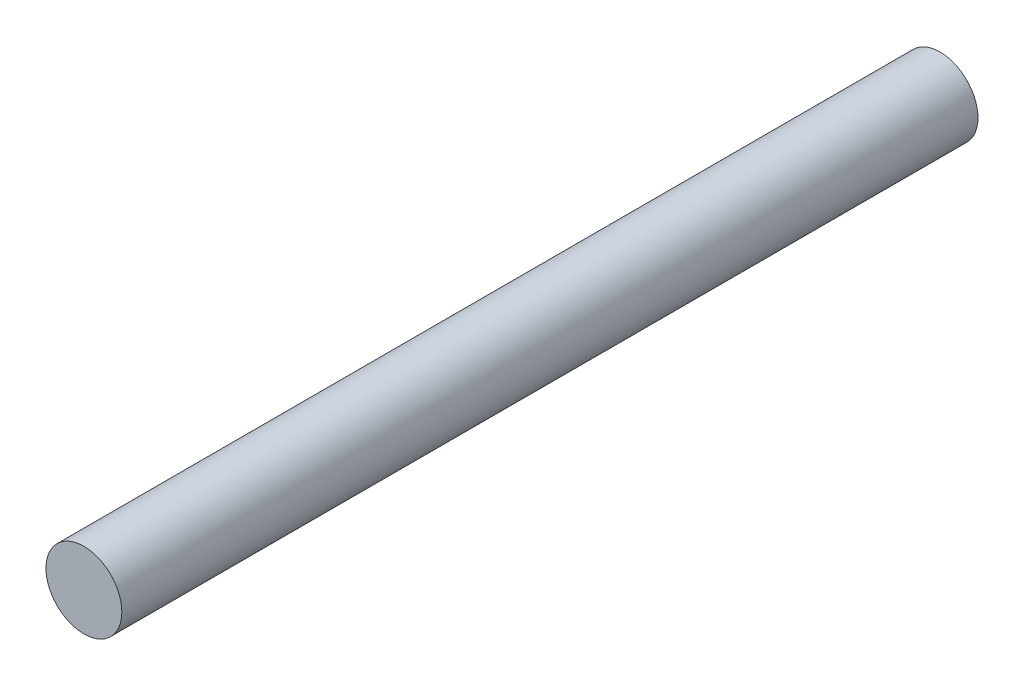
ISO-10303-21;
HEADER;
FILE_DESCRIPTION(('STEP AP214'),'2;1');
FILE_NAME('part.step','',(''),(''),'','','');
FILE_SCHEMA(('AUTOMOTIVE_DESIGN { 1 0 10303 214 1 1 1 1 }'));
ENDSEC;
DATA;
#1=APPLICATION_CONTEXT('core data for automotive mechanical design processes');
#2=APPLICATION_PROTOCOL_DEFINITION('international standard','automotive_design',2000,#1);
#3=PRODUCT_CONTEXT('',#1,'mechanical');
#4=PRODUCT('Part','Part','',(#3));
#5=PRODUCT_RELATED_PRODUCT_CATEGORY('part','',(#4));
#6=PRODUCT_DEFINITION_FORMATION('','',#4);
#7=PRODUCT_DEFINITION_CONTEXT('part definition',#1,'design');
#8=PRODUCT_DEFINITION('design','',#6,#7);
#9=PRODUCT_DEFINITION_SHAPE('','',#8);
#10=(LENGTH_UNIT() NAMED_UNIT(*) SI_UNIT(.MILLI.,.METRE.));
#11=(NAMED_UNIT(*) PLANE_ANGLE_UNIT() SI_UNIT($,.RADIAN.));
#12=(NAMED_UNIT(*) SI_UNIT($,.STERADIAN.) SOLID_ANGLE_UNIT());
#13=UNCERTAINTY_MEASURE_WITH_UNIT(LENGTH_MEASURE(1.E-05),#10,'distance_accuracy_value','');
#14=(GEOMETRIC_REPRESENTATION_CONTEXT(3) GLOBAL_UNCERTAINTY_ASSIGNED_CONTEXT((#13)) GLOBAL_UNIT_ASSIGNED_CONTEXT((#10,
#11,#12)) REPRESENTATION_CONTEXT('',''));
#15=CARTESIAN_POINT('',(0.,0.,0.));
#16=DIRECTION('',(0.,0.,1.));
#17=DIRECTION('',(1.,0.,0.));
#18=AXIS2_PLACEMENT_3D('',#15,#16,#17);
#19=CARTESIAN_POINT('',(58.4988216634351,28.8934474203841,-5.));
#20=DIRECTION('',(0.,0.,1.));
#21=DIRECTION('',(1.,0.,0.));
#22=AXIS2_PLACEMENT_3D('',#19,#20,#21);
#23=CYLINDRICAL_SURFACE('',#22,0.664999999999999);
#24=CARTESIAN_POINT('',(58.4988216634351,28.8934474203841,-5.));
#25=DIRECTION('',(0.,0.,1.));
#26=DIRECTION('',(1.,0.,0.));
#27=AXIS2_PLACEMENT_3D('',#24,#25,#26);
#28=CIRCLE('',#27,0.664999999999999);
#29=CARTESIAN_POINT('',(59.1638216634351,28.8934474203841,-5.));
#30=VERTEX_POINT('',#29);
#31=EDGE_CURVE('E10',#30,#30,#28,.T.);
#32=ORIENTED_EDGE('',*,*,#31,.T.);
#33=EDGE_LOOP('',(#32));
#34=FACE_BOUND('',#33,.T.);
#35=CARTESIAN_POINT('',(58.4988216634351,28.8934474203841,10.));
#36=DIRECTION('',(0.,0.,1.));
#37=DIRECTION('',(1.,0.,0.));
#38=AXIS2_PLACEMENT_3D('',#35,#36,#37);
#39=CIRCLE('',#38,0.664999999999999);
#40=CARTESIAN_POINT('',(59.1638216634351,28.8934474203841,10.));
#41=VERTEX_POINT('',#40);
#42=EDGE_CURVE('E36',#41,#41,#39,.T.);
#43=ORIENTED_EDGE('',*,*,#42,.F.);
#44=EDGE_LOOP('',(#43));
#45=FACE_BOUND('',#44,.T.);
#46=ADVANCED_FACE('F30',(#34,#45),#23,.T.);
#47=CARTESIAN_POINT('',(58.4988216634351,28.8934474203841,-5.));
#48=DIRECTION('',(0.,0.,1.));
#49=DIRECTION('',(1.,0.,0.));
#50=AXIS2_PLACEMENT_3D('',#47,#48,#49);
#51=PLANE('',#50);
#52=ORIENTED_EDGE('',*,*,#31,.F.);
#53=EDGE_LOOP('',(#52));
#54=FACE_BOUND('',#53,.T.);
#55=ADVANCED_FACE('F45',(#54),#51,.F.);
#56=CARTESIAN_POINT('',(58.4988216634351,28.8934474203841,10.));
#57=DIRECTION('',(0.,0.,1.));
#58=DIRECTION('',(1.,0.,0.));
#59=AXIS2_PLACEMENT_3D('',#56,#57,#58);
#60=PLANE('',#59);
#61=ORIENTED_EDGE('',*,*,#42,.T.);
#62=EDGE_LOOP('',(#61));
#63=FACE_BOUND('',#62,.T.);
#64=ADVANCED_FACE('F42',(#63),#60,.T.);
#65=CLOSED_SHELL('',(#46,#55,#64));
#66=MANIFOLD_SOLID_BREP('B2',#65);
#67=ADVANCED_BREP_SHAPE_REPRESENTATION('',(#18,#66),#14);
#68=SHAPE_DEFINITION_REPRESENTATION(#9,#67);
ENDSEC;
END-ISO-10303-21;
